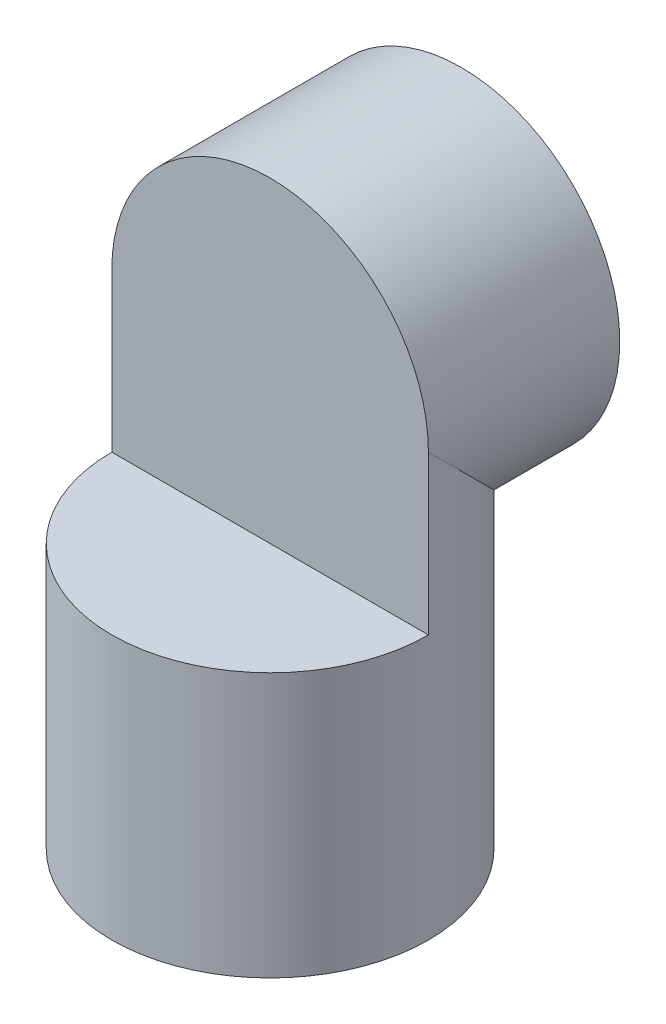
ISO-10303-21;
HEADER;
FILE_DESCRIPTION(('STEP AP214'),'2;1');
FILE_NAME('part.step','',(''),(''),'','','');
FILE_SCHEMA(('AUTOMOTIVE_DESIGN { 1 0 10303 214 1 1 1 1 }'));
ENDSEC;
DATA;
#1=APPLICATION_CONTEXT('core data for automotive mechanical design processes');
#2=APPLICATION_PROTOCOL_DEFINITION('international standard','automotive_design',2000,#1);
#3=PRODUCT_CONTEXT('',#1,'mechanical');
#4=PRODUCT('Part','Part','',(#3));
#5=PRODUCT_RELATED_PRODUCT_CATEGORY('part','',(#4));
#6=PRODUCT_DEFINITION_FORMATION('','',#4);
#7=PRODUCT_DEFINITION_CONTEXT('part definition',#1,'design');
#8=PRODUCT_DEFINITION('design','',#6,#7);
#9=PRODUCT_DEFINITION_SHAPE('','',#8);
#10=(LENGTH_UNIT() NAMED_UNIT(*) SI_UNIT(.MILLI.,.METRE.));
#11=(NAMED_UNIT(*) PLANE_ANGLE_UNIT() SI_UNIT($,.RADIAN.));
#12=(NAMED_UNIT(*) SI_UNIT($,.STERADIAN.) SOLID_ANGLE_UNIT());
#13=UNCERTAINTY_MEASURE_WITH_UNIT(LENGTH_MEASURE(1.E-05),#10,'distance_accuracy_value','');
#14=(GEOMETRIC_REPRESENTATION_CONTEXT(3) GLOBAL_UNCERTAINTY_ASSIGNED_CONTEXT((#13)) GLOBAL_UNIT_ASSIGNED_CONTEXT((#10,
#11,#12)) REPRESENTATION_CONTEXT('',''));
#15=CARTESIAN_POINT('',(0.,0.,0.));
#16=DIRECTION('',(0.,0.,1.));
#17=DIRECTION('',(1.,0.,0.));
#18=AXIS2_PLACEMENT_3D('',#15,#16,#17);
#19=CARTESIAN_POINT('',(3.87035861681925,10.2935424674176,-7.88415999999999));
#20=DIRECTION('',(0.0554460842403357,0.356398527819818,0.932687418758439));
#21=DIRECTION('',(0.747230831832866,-0.634386185883802,0.19799053290035));
#22=AXIS2_PLACEMENT_3D('',#19,#20,#21);
#23=SPHERICAL_SURFACE('',#22,1.30302);
#24=CARTESIAN_POINT('',(4.52186861681925,11.4219908890568,-7.88415999999999));
#25=CARTESIAN_POINT('',(4.58524511159546,11.3853941616951,-7.88415999999999));
#26=CARTESIAN_POINT('',(4.64560673372368,11.3433961616661,-7.88415999999999));
#27=CARTESIAN_POINT('',(4.73017243020277,11.2733037280284,-7.88415999999999));
#28=CARTESIAN_POINT('',(4.75738806042679,11.2487300708524,-7.88415999999999));
#29=CARTESIAN_POINT('',(4.80968111789197,11.1973554166368,-7.88415999999999));
#30=CARTESIAN_POINT('',(4.83475667093584,11.1705525070476,-7.88415999999999));
#31=CARTESIAN_POINT('',(4.90638280925672,11.0871861670358,-7.88415999999999));
#32=CARTESIAN_POINT('',(4.9494508218936,11.0275671481827,-7.88415999999999));
#33=CARTESIAN_POINT('',(5.02495351371586,10.901935907835,-7.88415999999999));
#34=CARTESIAN_POINT('',(5.05738794286766,10.8359235360571,-7.88415999999999));
#35=CARTESIAN_POINT('',(5.09737967387249,10.7335742768555,-7.88415999999999));
#36=CARTESIAN_POINT('',(5.10927196208888,10.6988785149595,-7.88415999999999));
#37=CARTESIAN_POINT('',(5.1300842864558,10.6286438280194,-7.88415999999999));
#38=CARTESIAN_POINT('',(5.13900717005937,10.5931057459455,-7.88415999999999));
#39=CARTESIAN_POINT('',(5.16123300634216,10.485524683916,-7.88415999999999));
#40=CARTESIAN_POINT('',(5.17000281024605,10.4124900792196,-7.88415999999998));
#41=CARTESIAN_POINT('',(5.17515007166113,10.2660248031217,-7.88415999999998));
#42=CARTESIAN_POINT('',(5.17152780766363,10.1925941406579,-7.88415999999999));
#43=CARTESIAN_POINT('',(5.15200841815195,10.0473733280716,-7.88415999999999));
#44=CARTESIAN_POINT('',(5.13611134336732,9.9755831711704,-7.88415999999998));
#45=CARTESIAN_POINT('',(5.09248963861125,9.83569319426743,-7.88415999999998));
#46=CARTESIAN_POINT('',(5.06476498034016,9.76759338309596,-7.88415999999998));
#47=CARTESIAN_POINT('',(4.99827703133339,9.63701444543887,-7.88415999999999));
#48=CARTESIAN_POINT('',(4.95951374780123,9.57453531528537,-7.88415999999999));
#49=CARTESIAN_POINT('',(4.87204557098117,9.45697131660213,-7.88415999999999));
#50=CARTESIAN_POINT('',(4.82334072684484,9.40188641151719,-7.88415999999999));
#51=CARTESIAN_POINT('',(4.71738369070506,9.3006777302423,-7.88415999999998));
#52=CARTESIAN_POINT('',(4.66013140861379,9.25455404851313,-7.88415999999998));
#53=CARTESIAN_POINT('',(4.53865691096502,9.17256024082702,-7.88415999999998));
#54=CARTESIAN_POINT('',(4.47443443254646,9.13669050175377,-7.88415999999999));
#55=CARTESIAN_POINT('',(4.37435976297924,9.09138187086448,-7.88415999999999));
#56=CARTESIAN_POINT('',(4.34037229473301,9.07769347605296,-7.88415999999999));
#57=CARTESIAN_POINT('',(4.27133280210008,9.05321055657434,-7.88415999999999));
#58=CARTESIAN_POINT('',(4.23627978198558,9.04241883747601,-7.88415999999999));
#59=CARTESIAN_POINT('',(4.12998636547158,9.01455484923799,-7.88415999999999));
#60=CARTESIAN_POINT('',(4.05752307311049,9.00195376875583,-7.88415999999999));
#61=CARTESIAN_POINT('',(3.91151313880725,8.98911211265607,-7.88415999999999));
#62=CARTESIAN_POINT('',(3.83796653815548,8.98887106714801,-7.88415999999998));
#63=CARTESIAN_POINT('',(3.72840456687758,8.99775699869372,-7.88415999999998));
#64=CARTESIAN_POINT('',(3.69196731383288,9.0022711289084,-7.88415999999999));
#65=CARTESIAN_POINT('',(3.61963737935746,9.01434557858398,-7.88415999999999));
#66=CARTESIAN_POINT('',(3.58374427949848,9.02190341992221,-7.88415999999999));
#67=CARTESIAN_POINT('',(3.47732368600113,9.049065965953,-7.88415999999999));
#68=CARTESIAN_POINT('',(3.40786108793911,9.07317557555688,-7.88415999999999));
#69=CARTESIAN_POINT('',(3.32013061080317,9.11217178748134,-7.88415999999999));
#70=CARTESIAN_POINT('',(3.29948921792143,9.12200855040117,-7.88415999999999));
#71=CARTESIAN_POINT('',(3.25875099304024,9.14275156381967,-7.88415999999999));
#72=CARTESIAN_POINT('',(3.23865416101547,9.15365781426863,-7.88415999999999));
#73=CARTESIAN_POINT('',(3.15551240025581,9.20166600908295,-7.88415999999999));
#74=CARTESIAN_POINT('',(3.09515506371442,9.24365786927063,-7.88415999999999));
#75=CARTESIAN_POINT('',(3.01058898232589,9.31374155834508,-7.88415999999999));
#76=CARTESIAN_POINT('',(2.98336356021063,9.3383222890233,-7.88415999999999));
#77=CARTESIAN_POINT('',(2.93105229755303,9.38971241393906,-7.88415999999999));
#78=CARTESIAN_POINT('',(2.90596821491817,9.41652360426644,-7.88415999999999));
#79=CARTESIAN_POINT('',(2.834334435861,9.49989858890438,-7.88415999999999));
#80=CARTESIAN_POINT('',(2.79126695017534,9.55951697737441,-7.88415999999999));
#81=CARTESIAN_POINT('',(2.71576428020977,9.68514800809728,-7.88415999999999));
#82=CARTESIAN_POINT('',(2.68332950021766,9.75116089336473,-7.88415999999999));
#83=CARTESIAN_POINT('',(2.64333779118745,9.85351005038402,-7.88415999999999));
#84=CARTESIAN_POINT('',(2.63144569673557,9.88820517498683,-7.88415999999999));
#85=CARTESIAN_POINT('',(2.61063366945449,9.95843847955993,-7.88415999999999));
#86=CARTESIAN_POINT('',(2.60171088206037,9.99397581444322,-7.88415999999999));
#87=CARTESIAN_POINT('',(2.57948456448724,10.1015574477484,-7.88415999999999));
#88=CARTESIAN_POINT('',(2.57071447703095,10.1745934529341,-7.88415999999999));
#89=CARTESIAN_POINT('',(2.56556715023456,10.3210603422578,-7.88415999999999));
#90=CARTESIAN_POINT('',(2.56918943067176,10.3944912109843,-7.88415999999999));
#91=CARTESIAN_POINT('',(2.58870892276454,10.539712023188,-7.88415999999999));
#92=CARTESIAN_POINT('',(2.60460601351572,10.6115019828209,-7.88415999999999));
#93=CARTESIAN_POINT('',(2.64822778009966,10.7513925101529,-7.88415999999999));
#94=CARTESIAN_POINT('',(2.67595265142324,10.8194930168515,-7.88415999999999));
#95=CARTESIAN_POINT('',(2.74244130918317,10.9500719800385,-7.88415999999999));
#96=CARTESIAN_POINT('',(2.78120483942072,11.012550566963,-7.88415999999999));
#97=CARTESIAN_POINT('',(2.86866747800773,11.1301088655871,-7.88415999999999));
#98=CARTESIAN_POINT('',(2.91736589386233,11.1851890925336,-7.88415999999999));
#99=CARTESIAN_POINT('',(3.02332798949608,11.2864011938424,-7.88415999999999));
#100=CARTESIAN_POINT('',(3.08059306051384,11.3325316119413,-7.88415999999998));
#101=CARTESIAN_POINT('',(3.20207114071159,11.4145361556932,-7.88415999999998));
#102=CARTESIAN_POINT('',(3.26628647109733,11.4504068402025,-7.88415999999999));
#103=CARTESIAN_POINT('',(3.39979203104228,11.5108297513031,-7.88415999999999));
#104=CARTESIAN_POINT('',(3.46907799230358,11.5353913733461,-7.88415999999998));
#105=CARTESIAN_POINT('',(3.59376743926616,11.5680874525024,-7.88415999999998));
#106=CARTESIAN_POINT('',(3.64852373284443,11.5787468193743,-7.88415999999999));
#107=CARTESIAN_POINT('',(3.75896706335442,11.5929859875889,-7.88415999999999));
#108=CARTESIAN_POINT('',(3.81465437144129,11.5965636888757,-7.88415999999999));
#109=CARTESIAN_POINT('',(3.9436276211118,11.5965608608072,-7.88415999999999));
#110=CARTESIAN_POINT('',(4.01692592812468,11.5903674628555,-7.88415999999999));
#111=CARTESIAN_POINT('',(4.16140470359913,11.5657521157546,-7.88415999999999));
#112=CARTESIAN_POINT('',(4.23258655021281,11.5473383146794,-7.88415999999999));
#113=CARTESIAN_POINT('',(4.339844406405,11.5097188509967,-7.88415999999999));
#114=CARTESIAN_POINT('',(4.37738094611545,11.4945518372074,-7.88415999999999));
#115=CARTESIAN_POINT('',(4.45087484622059,11.4608034294557,-7.88415999999999));
#116=CARTESIAN_POINT('',(4.48683242941318,11.4422225191402,-7.88415999999999));
#117=CARTESIAN_POINT('',(4.52186861681925,11.4219908890568,-7.88415999999999));
#118=B_SPLINE_CURVE_WITH_KNOTS('',3,(#24,#25,#26,#27,#28,#29,#30,#31,#32,#33,#34,#35,#36,#37,
#38,#39,#40,#41,#42,#43,#44,#45,#46,#47,#48,#49,#50,#51,#52,#53,#54,#55,#56,#57,#58,#59,#60,#61,
#62,#63,#64,#65,#66,#67,#68,#69,#70,#71,#72,#73,#74,#75,#76,#77,#78,#79,#80,#81,#82,#83,#84,#85,
#86,#87,#88,#89,#90,#91,#92,#93,#94,#95,#96,#97,#98,#99,#100,#101,#102,#103,#104,#105,#106,#107,
#108,#109,#110,#111,#112,#113,#114,#115,#116,#117),.UNSPECIFIED.,.T.,.F.,(4,2,2,2,2,2,2,2,2,2,2,
2,2,2,2,2,2,2,2,2,2,2,2,2,2,2,2,2,2,2,2,2,2,2,2,2,2,2,2,2,2,2,2,2,2,2,4),(0.,0.219378386419227,
0.329278248766021,0.439273390150621,0.658809610523647,0.878350992608082,0.988268226187612,
1.09807975098427,1.31762393973005,1.53716319461425,1.75670154218772,1.97624041504927,
2.19577914464539,2.41531678885722,2.63485674710303,2.85440498755087,2.96421434799376,
3.07412968338468,3.29367265779028,3.51320728584178,3.62323684713202,3.73317700530027,
3.95248087473943,4.02105825996424,4.08963564200267,4.30893948324564,4.41887965554408,
4.52890923097547,4.74844385900095,4.96798683343258,5.07790209388056,5.1877113791566,
5.40725976931368,5.62679965174047,5.84633737177132,6.06587872048561,6.28541497422878,
6.50493593078377,6.72449257667609,6.94412277636537,7.16357017886179,7.33048511739908,
7.49744954686479,7.71706148875941,7.9365271491483,8.05782244173021,8.17910056363588),.UNSPECIFIED.);
#119=CARTESIAN_POINT('',(4.52186861681925,11.4219908890568,-7.88415999999999));
#120=VERTEX_POINT('',#119);
#121=EDGE_CURVE('E114',#120,#120,#118,.T.);
#122=ORIENTED_EDGE('',*,*,#121,.T.);
#123=EDGE_LOOP('',(#122));
#124=FACE_BOUND('',#123,.T.);
#125=CARTESIAN_POINT('',(3.7981112601324,9.82914805769781,-9.09947036039061));
#126=VERTEX_POINT('',#125);
#127=VERTEX_LOOP('',#126);
#128=FACE_BOUND('',#127,.T.);
#129=ADVANCED_FACE('F16',(#124,#128),#23,.T.);
#130=CARTESIAN_POINT('',(-4.95227482907353,7.59619273174486,-7.88415999999999));
#131=DIRECTION('',(0.0554460842403357,0.356398527819818,0.932687418758439));
#132=DIRECTION('',(0.747230831832866,-0.634386185883802,0.19799053290035));
#133=AXIS2_PLACEMENT_3D('',#130,#131,#132);
#134=SPHERICAL_SURFACE('',#133,1.30302);
#135=CARTESIAN_POINT('',(-3.64925482907353,7.59619273174486,-7.88415999999999));
#136=CARTESIAN_POINT('',(-3.64926013323451,7.52298608795469,-7.88415999999999));
#137=CARTESIAN_POINT('',(-3.65545301004078,7.44970695941227,-7.88415999999999));
#138=CARTESIAN_POINT('',(-3.67387633003305,7.34142183427563,-7.88415999999999));
#139=CARTESIAN_POINT('',(-3.68154924971922,7.30557195673762,-7.88415999999999));
#140=CARTESIAN_POINT('',(-3.69989218882068,7.23461001622985,-7.88415999999999));
#141=CARTESIAN_POINT('',(-3.71056486754989,7.19949863776709,-7.88415999999999));
#142=CARTESIAN_POINT('',(-3.74694719846247,7.09579128268684,-7.88415999999999));
#143=CARTESIAN_POINT('',(-3.77704488210218,7.02868346285482,-7.88415999999999));
#144=CARTESIAN_POINT('',(-3.84809344444015,6.90048053828299,-7.88415999999999));
#145=CARTESIAN_POINT('',(-3.88904451513782,6.83938553993786,-7.88415999999998));
#146=CARTESIAN_POINT('',(-3.95768571586553,6.7535770583075,-7.88415999999998));
#147=CARTESIAN_POINT('',(-3.98178713860005,6.72592998652058,-7.88415999999999));
#148=CARTESIAN_POINT('',(-4.03220636111199,6.67278831331038,-7.88415999999999));
#149=CARTESIAN_POINT('',(-4.05852200921787,6.64729166938281,-7.88415999999999));
#150=CARTESIAN_POINT('',(-4.14057693780854,6.57425324129018,-7.88415999999999));
#151=CARTESIAN_POINT('',(-4.19944148998978,6.53014139322371,-7.88415999999999));
#152=CARTESIAN_POINT('',(-4.32371006126056,6.45245137600196,-7.88415999999999));
#153=CARTESIAN_POINT('',(-4.3891139727794,6.41887303361091,-7.88415999999999));
#154=CARTESIAN_POINT('',(-4.52463857529629,6.36316690106079,-7.88415999999998));
#155=CARTESIAN_POINT('',(-4.59475925226998,6.34103907685762,-7.88415999999998));
#156=CARTESIAN_POINT('',(-4.73771840709602,6.30887158640024,-7.88415999999998));
#157=CARTESIAN_POINT('',(-4.81055688939089,6.29883193990629,-7.88415999999998));
#158=CARTESIAN_POINT('',(-4.95688554084974,6.29112271957427,-7.88415999999999));
#159=CARTESIAN_POINT('',(-5.03037570982069,6.29345314207251,-7.88415999999999));
#160=CARTESIAN_POINT('',(-5.17592322952622,6.31042080842255,-7.88415999999999));
#161=CARTESIAN_POINT('',(-5.24798058742457,6.32505799072726,-7.88415999999999));
#162=CARTESIAN_POINT('',(-5.38860839370869,6.36621513796668,-7.88415999999999));
#163=CARTESIAN_POINT('',(-5.45717880617751,6.39273522527255,-7.88415999999999));
#164=CARTESIAN_POINT('',(-5.58892476649786,6.45693831796772,-7.88415999999999));
#165=CARTESIAN_POINT('',(-5.65210011014942,6.49462174564139,-7.88415999999999));
#166=CARTESIAN_POINT('',(-5.7413758700395,6.55863463581959,-7.88415999999999));
#167=CARTESIAN_POINT('',(-5.77022410224404,6.58122444958748,-7.88415999999999));
#168=CARTESIAN_POINT('',(-5.8259466796095,6.62877294492256,-7.88415999999999));
#169=CARTESIAN_POINT('',(-5.8528190929406,6.6537338915996,-7.88415999999999));
#170=CARTESIAN_POINT('',(-5.93009672320717,6.73185469678521,-7.88415999999999));
#171=CARTESIAN_POINT('',(-5.97724122519228,6.78830920855986,-7.88415999999999));
#172=CARTESIAN_POINT('',(-6.06136739275452,6.90833669281432,-7.88415999999999));
#173=CARTESIAN_POINT('',(-6.0983494446195,6.97190939459322,-7.88415999999999));
#174=CARTESIAN_POINT('',(-6.14543499163566,7.07123581886392,-7.88415999999999));
#175=CARTESIAN_POINT('',(-6.15974426985393,7.10504847913332,-7.88415999999999));
#176=CARTESIAN_POINT('',(-6.1854524617719,7.17372528189841,-7.88415999999999));
#177=CARTESIAN_POINT('',(-6.196853730805,7.20858854770153,-7.88415999999999));
#178=CARTESIAN_POINT('',(-6.22654056592724,7.31433275084445,-7.88415999999999));
#179=CARTESIAN_POINT('',(-6.24039232567356,7.3865439127042,-7.88415999999999));
#180=CARTESIAN_POINT('',(-6.25048585144912,7.48201881583139,-7.88415999999999));
#181=CARTESIAN_POINT('',(-6.25228766094182,7.50481316083971,-7.88415999999999));
#182=CARTESIAN_POINT('',(-6.2546927975489,7.55046500516846,-7.88415999999999));
#183=CARTESIAN_POINT('',(-6.25529612397902,7.57332250452494,-7.88415999999999));
#184=CARTESIAN_POINT('',(-6.25529068809438,7.66932944722695,-7.88415999999999));
#185=CARTESIAN_POINT('',(-6.24910334540213,7.74259632508082,-7.88415999999999));
#186=CARTESIAN_POINT('',(-6.23069214408464,7.85087452446103,-7.88415999999999));
#187=CARTESIAN_POINT('',(-6.22301731677818,7.88674281401864,-7.88415999999999));
#188=CARTESIAN_POINT('',(-6.20466778872739,7.95774079732341,-7.88415999999999));
#189=CARTESIAN_POINT('',(-6.19399065314793,7.99286986661469,-7.88415999999999));
#190=CARTESIAN_POINT('',(-6.15760266549476,8.09659408893003,-7.88415999999999));
#191=CARTESIAN_POINT('',(-6.12750534354986,8.16370085464712,-7.88415999999999));
#192=CARTESIAN_POINT('',(-6.05645701914395,8.29190359379009,-7.88415999999999));
#193=CARTESIAN_POINT('',(-6.01550561562198,8.35299934499311,-7.88415999999999));
#194=CARTESIAN_POINT('',(-5.94686709352054,8.43880445967804,-7.88415999999999));
#195=CARTESIAN_POINT('',(-5.9227691421672,8.46644783261777,-7.88415999999999));
#196=CARTESIAN_POINT('',(-5.87235760257589,8.51958273558884,-7.88415999999999));
#197=CARTESIAN_POINT('',(-5.84604616409878,8.54507630641501,-7.88415999999999));
#198=CARTESIAN_POINT('',(-5.76398864016459,8.61812005816577,-7.88415999999999));
#199=CARTESIAN_POINT('',(-5.70511483629564,8.66223890537681,-7.88415999999999));
#200=CARTESIAN_POINT('',(-5.58080702873803,8.73995544490071,-7.88415999999999));
#201=CARTESIAN_POINT('',(-5.51537040813671,8.77354891804166,-7.88415999999999));
#202=CARTESIAN_POINT('',(-5.37982548603953,8.82924409236902,-7.88415999999999));
#203=CARTESIAN_POINT('',(-5.309722458685,8.85135852687703,-7.88415999999999));
#204=CARTESIAN_POINT('',(-5.19140587531833,8.87798636586236,-7.88415999999999));
#205=CARTESIAN_POINT('',(-5.14393633015925,8.88593560360622,-7.88415999999999));
#206=CARTESIAN_POINT('',(-5.0484097643924,8.89654979864893,-7.88415999999999));
#207=CARTESIAN_POINT('',(-5.00035274348658,8.89921475326663,-7.88415999999999));
#208=CARTESIAN_POINT('',(-4.87907732348959,8.89920965402503,-7.88415999999999));
#209=CARTESIAN_POINT('',(-4.8058313881062,8.8930246979751,-7.88415999999999));
#210=CARTESIAN_POINT('',(-4.66136166778535,8.86843914159504,-7.88415999999999));
#211=CARTESIAN_POINT('',(-4.59014020851846,8.85002504070165,-7.88415999999999));
#212=CARTESIAN_POINT('',(-4.451824801241,8.8015050319548,-7.88415999999999));
#213=CARTESIAN_POINT('',(-4.38472912579874,8.77140405644534,-7.88415999999999));
#214=CARTESIAN_POINT('',(-4.25656315203348,8.70037283298813,-7.88415999999999));
#215=CARTESIAN_POINT('',(-4.19549128250978,8.65944541922999,-7.88415999999999));
#216=CARTESIAN_POINT('',(-4.08108390926332,8.56792004869084,-7.88415999999999));
#217=CARTESIAN_POINT('',(-4.02774840680617,8.51732209032779,-7.88415999999999));
#218=CARTESIAN_POINT('',(-3.93031502640777,8.40787492025768,-7.88415999999999));
#219=CARTESIAN_POINT('',(-3.8862195655907,8.34902355622688,-7.88415999999999));
#220=CARTESIAN_POINT('',(-3.80852039016171,8.22473280732671,-7.88415999999999));
#221=CARTESIAN_POINT('',(-3.77492110500135,8.15929065646808,-7.88415999999999));
#222=CARTESIAN_POINT('',(-3.71922145857753,8.02374213970403,-7.88415999999999));
#223=CARTESIAN_POINT('',(-3.69710844789485,7.95364100098458,-7.88415999999999));
#224=CARTESIAN_POINT('',(-3.67048161354327,7.83532350741838,-7.88415999999999));
#225=CARTESIAN_POINT('',(-3.66253241632917,7.78785260454892,-7.88415999999999));
#226=CARTESIAN_POINT('',(-3.65191728523269,7.6923291349659,-7.88415999999999));
#227=CARTESIAN_POINT('',(-3.64925134517645,7.64427656893213,-7.88415999999999));
#228=CARTESIAN_POINT('',(-3.64925482907353,7.59619273174486,-7.88415999999999));
#229=B_SPLINE_CURVE_WITH_KNOTS('',3,(#135,#136,#137,#138,#139,#140,#141,#142,#143,#144,#145,
#146,#147,#148,#149,#150,#151,#152,#153,#154,#155,#156,#157,#158,#159,#160,#161,#162,#163,#164,
#165,#166,#167,#168,#169,#170,#171,#172,#173,#174,#175,#176,#177,#178,#179,#180,#181,#182,#183,
#184,#185,#186,#187,#188,#189,#190,#191,#192,#193,#194,#195,#196,#197,#198,#199,#200,#201,#202,
#203,#204,#205,#206,#207,#208,#209,#210,#211,#212,#213,#214,#215,#216,#217,#218,#219,#220,#221,
#222,#223,#224,#225,#226,#227,#228),.UNSPECIFIED.,.T.,.F.,(4,2,2,2,2,2,2,2,2,2,2,2,2,2,2,2,2,2,
2,2,2,2,2,2,2,2,2,2,2,2,2,2,2,2,2,2,2,2,2,2,2,2,2,2,2,2,4),(0.,0.219417663022593,
0.32929661535836,0.439273285303822,0.658810144569198,0.878350887761373,0.988268796858262,
1.09808110034609,1.31762383876354,1.53716296635557,1.75670144122121,1.97624027496075,
2.19577904367889,2.41531671447293,2.63485664613652,2.85440488356904,2.96421424552706,
3.07412958242624,3.2936725567881,3.51320718488335,3.6232367729082,3.73317695775453,
3.95248077392299,4.02105813797726,4.08963554118622,4.30893926645157,4.41887948915886,
4.52890913046816,4.74844387520007,4.9679867329253,5.07788943992205,5.18768661404452,
5.40725960297966,5.62692049704936,5.84633720495202,5.99045590957346,6.13457468731788,
6.35399217178003,6.57365228929639,6.79321980176309,7.01272989172723,7.23224001760174,
7.45180749415813,7.67146750477682,7.89088509613749,8.03500392152698,8.17912257850335),.UNSPECIFIED.);
#230=CARTESIAN_POINT('',(-3.64925482907353,7.59619273174486,-7.88415999999999));
#231=VERTEX_POINT('',#230);
#232=EDGE_CURVE('E112',#231,#231,#229,.T.);
#233=ORIENTED_EDGE('',*,*,#232,.T.);
#234=EDGE_LOOP('',(#233));
#235=FACE_BOUND('',#234,.T.);
#236=CARTESIAN_POINT('',(-5.02452218576037,7.13179832202509,-9.09947036039061));
#237=VERTEX_POINT('',#236);
#238=VERTEX_LOOP('',#237);
#239=FACE_BOUND('',#238,.T.);
#240=ADVANCED_FACE('F62',(#235,#239),#134,.T.);
#241=CARTESIAN_POINT('',(1.79501528785667,1.30424290715994,-7.88415999999999));
#242=DIRECTION('',(0.0554460842403357,0.356398527819818,0.932687418758439));
#243=DIRECTION('',(0.747230831832866,-0.634386185883802,0.19799053290035));
#244=AXIS2_PLACEMENT_3D('',#241,#242,#243);
#245=SPHERICAL_SURFACE('',#244,1.30302);
#246=CARTESIAN_POINT('',(1.72276793116983,0.839848497440159,-9.09947036039061));
#247=VERTEX_POINT('',#246);
#248=VERTEX_LOOP('',#247);
#249=FACE_BOUND('',#248,.T.);
#250=CARTESIAN_POINT('',(2.44652528785667,0.175794485520738,-7.88415999999999));
#251=CARTESIAN_POINT('',(2.38311513409538,0.139187516944448,-7.88415999999999));
#252=CARTESIAN_POINT('',(2.31658331775141,0.107920018965464,-7.88415999999999));
#253=CARTESIAN_POINT('',(2.1791784690996,0.0569832892573211,-7.88415999999999));
#254=CARTESIAN_POINT('',(2.10830212710155,0.0373230243185771,-7.88415999999999));
#255=CARTESIAN_POINT('',(1.96427236133052,0.0101872228764311,-7.88415999999999));
#256=CARTESIAN_POINT('',(1.89111964602088,0.00270793325134912,-7.88415999999999));
#257=CARTESIAN_POINT('',(1.74460938188207,0.000138586573471745,-7.88415999999999));
#258=CARTESIAN_POINT('',(1.67125186647279,0.00504661409531083,-7.88415999999999));
#259=CARTESIAN_POINT('',(1.52639672455706,0.027108309268628,-7.88415999999999));
#260=CARTESIAN_POINT('',(1.45489922045403,0.0442627807306186,-7.88415999999999));
#261=CARTESIAN_POINT('',(1.31579740264871,0.0903320991086586,-7.88415999999999));
#262=CARTESIAN_POINT('',(1.24819317991611,0.119247220694686,-7.88415999999999));
#263=CARTESIAN_POINT('',(1.11879946864029,0.18801658992001,-7.88415999999999));
#264=CARTESIAN_POINT('',(1.05700991773207,0.227870720215489,-7.88415999999999));
#265=CARTESIAN_POINT('',(0.94099887782925,0.317386766186831,-7.88415999999999));
#266=CARTESIAN_POINT('',(0.886777374436967,0.367048663203659,-7.88415999999999));
#267=CARTESIAN_POINT('',(0.787441476225722,0.474770822756988,-7.88415999999999));
#268=CARTESIAN_POINT('',(0.742327088768831,0.532831092082557,-7.88415999999999));
#269=CARTESIAN_POINT('',(0.662485959657491,0.65570090607362,-7.88415999999999));
#270=CARTESIAN_POINT('',(0.627759220970729,0.720510452667333,-7.88415999999998));
#271=CARTESIAN_POINT('',(0.569679983753614,0.855042153221034,-7.88415999999998));
#272=CARTESIAN_POINT('',(0.546327429181894,0.924764282974457,-7.88415999999999));
#273=CARTESIAN_POINT('',(0.511656639997048,1.06713011848868,-7.88415999999999));
#274=CARTESIAN_POINT('',(0.500338520537503,1.13977385219845,-7.88415999999998));
#275=CARTESIAN_POINT('',(0.490067058631977,1.2859707287059,-7.88415999999998));
#276=CARTESIAN_POINT('',(0.491114190242904,1.35952390626169,-7.88415999999999));
#277=CARTESIAN_POINT('',(0.501913101481949,1.46884543260158,-7.88415999999999));
#278=CARTESIAN_POINT('',(0.507052338228395,1.505123636261,-7.88415999999999));
#279=CARTESIAN_POINT('',(0.520369253430476,1.57715504107626,-7.88415999999999));
#280=CARTESIAN_POINT('',(0.528549859427236,1.6129077017762,-7.88415999999999));
#281=CARTESIAN_POINT('',(0.557565646283894,1.71889249293365,-7.88415999999999));
#282=CARTESIAN_POINT('',(0.582884440664142,1.78794808837646,-7.88415999999999));
#283=CARTESIAN_POINT('',(0.644768201001383,1.92081722602627,-7.88415999999999));
#284=CARTESIAN_POINT('',(0.681332738640199,1.9846309677632,-7.88415999999999));
#285=CARTESIAN_POINT('',(0.743809827046953,2.07507238529566,-7.88415999999999));
#286=CARTESIAN_POINT('',(0.765938537014682,2.10437178419542,-7.88415999999999));
#287=CARTESIAN_POINT('',(0.812561844497441,2.16097574973733,-7.88415999999999));
#288=CARTESIAN_POINT('',(0.837054506725293,2.18828191653741,-7.88415999999999));
#289=CARTESIAN_POINT('',(0.913788092347483,2.26686243137652,-7.88415999999999));
#290=CARTESIAN_POINT('',(0.969397910212829,2.31496250590079,-7.88415999999998));
#291=CARTESIAN_POINT('',(1.04703007505341,2.37143818697301,-7.88415999999999));
#292=CARTESIAN_POINT('',(1.06586725683787,2.38439435457533,-7.88415999999999));
#293=CARTESIAN_POINT('',(1.10420140329603,2.40930372396912,-7.88415999999998));
#294=CARTESIAN_POINT('',(1.12369850706467,2.42125671244497,-7.88415999999997));
#295=CARTESIAN_POINT('',(1.20688267731826,2.46927961346955,-7.88415999999996));
#296=CARTESIAN_POINT('',(1.27343072833325,2.50056048934721,-7.88415999999998));
#297=CARTESIAN_POINT('',(1.41087095008939,2.55150868812081,-7.88415999999999));
#298=CARTESIAN_POINT('',(1.48176636191299,2.57116722713487,-7.88415999999999));
#299=CARTESIAN_POINT('',(1.59351871988414,2.59222603247628,-7.88415999999999));
#300=CARTESIAN_POINT('',(1.63361639724518,2.59786021429218,-7.88415999999999));
#301=CARTESIAN_POINT('',(1.71413875252601,2.60537936455124,-7.88415999999999));
#302=CARTESIAN_POINT('',(1.75456328037348,2.60726596531486,-7.88415999999999));
#303=CARTESIAN_POINT('',(1.86819623008649,2.60725737471117,-7.88415999999999));
#304=CARTESIAN_POINT('',(1.94146710691626,2.60106741825367,-7.88415999999999));
#305=CARTESIAN_POINT('',(2.0497480964794,2.58264943555713,-7.88415999999999));
#306=CARTESIAN_POINT('',(2.08560582257212,2.57497570669483,-7.88415999999999));
#307=CARTESIAN_POINT('',(2.15658315837816,2.55662998093093,-7.88415999999999));
#308=CARTESIAN_POINT('',(2.19170210142324,2.54595539116646,-7.88415999999999));
#309=CARTESIAN_POINT('',(2.29541671182698,2.50957060966136,-7.88415999999999));
#310=CARTESIAN_POINT('',(2.36252421161259,2.47947303025606,-7.88415999999999));
#311=CARTESIAN_POINT('',(2.49072707889656,2.40842452995385,-7.88415999999999));
#312=CARTESIAN_POINT('',(2.55182230504683,2.36747335397325,-7.88415999999999));
#313=CARTESIAN_POINT('',(2.63763075546259,2.29883218842649,-7.88415999999999));
#314=CARTESIAN_POINT('',(2.66527762819085,2.27473095142865,-7.88415999999999));
#315=CARTESIAN_POINT('',(2.71841891518949,2.22431215602535,-7.88415999999999));
#316=CARTESIAN_POINT('',(2.7439153739269,2.1979967513654,-7.88415999999999));
#317=CARTESIAN_POINT('',(2.81695408834954,2.11594171805182,-7.88415999999999));
#318=CARTESIAN_POINT('',(2.86106632013957,2.05707672788365,-7.88415999999999));
#319=CARTESIAN_POINT('',(2.93875662983901,1.93280770518481,-7.88415999999999));
#320=CARTESIAN_POINT('',(2.97233496775292,1.86740383410367,-7.88415999999999));
#321=CARTESIAN_POINT('',(3.02804108708775,1.73187921116903,-7.88415999999999));
#322=CARTESIAN_POINT('',(3.05016889237645,1.66175846914785,-7.88415999999999));
#323=CARTESIAN_POINT('',(3.08233667554334,1.51879849078049,-7.88415999999999));
#324=CARTESIAN_POINT('',(3.09237648937863,1.44595921755566,-7.88415999999999));
#325=CARTESIAN_POINT('',(3.10008508191377,1.29963018852959,-7.88415999999999));
#326=CARTESIAN_POINT('',(3.09775417058072,1.2261404490728,-7.88415999999999));
#327=CARTESIAN_POINT('',(3.08078843019435,1.08060047681797,-7.88415999999999));
#328=CARTESIAN_POINT('',(3.06615440538831,1.00855015024152,-7.88415999999999));
#329=CARTESIAN_POINT('',(3.02499451472537,0.867916874126345,-7.88415999999999));
#330=CARTESIAN_POINT('',(2.99846679652465,0.799334466539254,-7.88415999999999));
#331=CARTESIAN_POINT('',(2.9342670308533,0.667579642736839,-7.88415999999999));
#332=CARTESIAN_POINT('',(2.89659155420672,0.604408898932023,-7.88415999999999));
#333=CARTESIAN_POINT('',(2.81118451399153,0.485327917032741,-7.88415999999999));
#334=CARTESIAN_POINT('',(2.76346073008986,0.429412115786886,-7.88415999999999));
#335=CARTESIAN_POINT('',(2.6718167574179,0.338744336273802,-7.88415999999999));
#336=CARTESIAN_POINT('',(2.62971916451925,0.302129820911197,-7.88415999999999));
#337=CARTESIAN_POINT('',(2.54119161585935,0.234578432931325,-7.88415999999999));
#338=CARTESIAN_POINT('',(2.49476165952646,0.20364156106321,-7.88415999999999));
#339=CARTESIAN_POINT('',(2.44652528785667,0.175794485520738,-7.88415999999999));
#340=B_SPLINE_CURVE_WITH_KNOTS('',3,(#250,#251,#252,#253,#254,#255,#256,#257,#258,#259,#260,
#261,#262,#263,#264,#265,#266,#267,#268,#269,#270,#271,#272,#273,#274,#275,#276,#277,#278,#279,
#280,#281,#282,#283,#284,#285,#286,#287,#288,#289,#290,#291,#292,#293,#294,#295,#296,#297,#298,
#299,#300,#301,#302,#303,#304,#305,#306,#307,#308,#309,#310,#311,#312,#313,#314,#315,#316,#317,
#318,#319,#320,#321,#322,#323,#324,#325,#326,#327,#328,#329,#330,#331,#332,#333,#334,#335,#336,
#337,#338,#339),.UNSPECIFIED.,.T.,.F.,(4,2,2,2,2,2,2,2,2,2,2,2,2,2,2,2,2,2,2,2,2,2,2,2,2,2,2,2,
2,2,2,2,2,2,2,2,2,2,2,2,2,2,2,2,4),(0.,0.219454145571273,0.439077602224353,0.658633377137384,
0.878155204672647,1.09769144211979,1.31723280713011,1.53677181719073,1.75631040958778,
1.97584917945622,2.19538801204546,2.4149257629412,2.63446561450309,2.85401388277409,
2.9638232295507,3.0737385507103,3.29328153230315,3.51281615316741,3.62284909642525,
3.73279271143866,3.95208976024496,4.02065987188946,4.08924452750766,4.30870050452155,
4.52832212974201,4.64963526274175,4.77089554421841,4.99026516777055,5.10016943522743,
5.21016895775205,5.42970517895694,5.64924656020951,5.75916366281478,5.86897505723086,
6.08851950663413,6.30805853667022,6.5275971090918,6.74713866077915,6.96667471154923,
7.18619641249267,7.40575231399738,7.62537582370605,7.84482991622144,8.01176958921685,
8.17870928423955),.UNSPECIFIED.);
#341=CARTESIAN_POINT('',(2.44652528785667,0.175794485520738,-7.88415999999999));
#342=VERTEX_POINT('',#341);
#343=EDGE_CURVE('E110',#342,#342,#340,.T.);
#344=ORIENTED_EDGE('',*,*,#343,.T.);
#345=EDGE_LOOP('',(#344));
#346=FACE_BOUND('',#345,.T.);
#347=ADVANCED_FACE('F68',(#249,#346),#245,.T.);
#348=CARTESIAN_POINT('',(0.,6.45287,-7.88415999999999));
#349=DIRECTION('',(0.,0.,1.));
#350=DIRECTION('',(1.,0.,0.));
#351=AXIS2_PLACEMENT_3D('',#348,#349,#350);
#352=PLANE('',#351);
#353=CARTESIAN_POINT('',(0.,6.45287,-7.88415999999999));
#354=DIRECTION('',(0.,0.,1.));
#355=DIRECTION('',(1.,0.,0.));
#356=AXIS2_PLACEMENT_3D('',#353,#354,#355);
#357=CIRCLE('',#356,7.72922);
#358=CARTESIAN_POINT('',(7.72922,6.45287,-7.88415999999999));
#359=VERTEX_POINT('',#358);
#360=EDGE_CURVE('E133',#359,#359,#357,.T.);
#361=ORIENTED_EDGE('',*,*,#360,.F.);
#362=EDGE_LOOP('',(#361));
#363=FACE_BOUND('',#362,.T.);
#364=ORIENTED_EDGE('',*,*,#343,.F.);
#365=EDGE_LOOP('',(#364));
#366=FACE_BOUND('',#365,.T.);
#367=ORIENTED_EDGE('',*,*,#232,.F.);
#368=EDGE_LOOP('',(#367));
#369=FACE_BOUND('',#368,.T.);
#370=ORIENTED_EDGE('',*,*,#121,.F.);
#371=EDGE_LOOP('',(#370));
#372=FACE_BOUND('',#371,.T.);
#373=ADVANCED_FACE('F93',(#363,#366,#369,#372),#352,.F.);
#374=CARTESIAN_POINT('',(11.3796992217958,-1.27635,1.45796000000001));
#375=DIRECTION('',(0.,-1.,0.));
#376=DIRECTION('',(0.,0.,-1.));
#377=AXIS2_PLACEMENT_3D('',#374,#375,#376);
#378=PLANE('',#377);
#379=DIRECTION('',(1.,0.,0.));
#380=VECTOR('',#379,1.);
#381=CARTESIAN_POINT('',(-2.47986509012892,-1.27635,1.45796000000001));
#382=LINE('',#381,#380);
#383=CARTESIAN_POINT('',(-7.72922,-1.27635,1.45796000000002));
#384=VERTEX_POINT('',#383);
#385=CARTESIAN_POINT('',(7.72922,-1.27635,1.45796000000001));
#386=VERTEX_POINT('',#385);
#387=EDGE_CURVE('E132',#384,#386,#382,.T.);
#388=ORIENTED_EDGE('',*,*,#387,.F.);
#389=CARTESIAN_POINT('',(0.,-1.27635,1.45796000000002));
#390=DIRECTION('',(0.,-1.,0.));
#391=DIRECTION('',(0.,0.,-1.));
#392=AXIS2_PLACEMENT_3D('',#389,#390,#391);
#393=CIRCLE('',#392,7.72922);
#394=EDGE_CURVE('E51',#386,#384,#393,.T.);
#395=ORIENTED_EDGE('',*,*,#394,.F.);
#396=EDGE_LOOP('',(#388,#395));
#397=FACE_BOUND('',#396,.T.);
#398=ADVANCED_FACE('F90',(#397),#378,.F.);
#399=CARTESIAN_POINT('',(0.,-14.18209,1.45796000000002));
#400=DIRECTION('',(0.,-1.,0.));
#401=DIRECTION('',(0.,0.,-1.));
#402=AXIS2_PLACEMENT_3D('',#399,#400,#401);
#403=PLANE('',#402);
#404=CARTESIAN_POINT('',(0.,-14.18209,1.45796000000002));
#405=DIRECTION('',(0.,-1.,0.));
#406=DIRECTION('',(0.,0.,-1.));
#407=AXIS2_PLACEMENT_3D('',#404,#405,#406);
#408=CIRCLE('',#407,7.72922);
#409=CARTESIAN_POINT('',(0.,-14.18209,-6.27125999999998));
#410=VERTEX_POINT('',#409);
#411=EDGE_CURVE('E129',#410,#410,#408,.F.);
#412=ORIENTED_EDGE('',*,*,#411,.F.);
#413=EDGE_LOOP('',(#412));
#414=FACE_BOUND('',#413,.T.);
#415=ADVANCED_FACE('F87',(#414),#403,.T.);
#416=CARTESIAN_POINT('',(0.,6.45287,-7.88415999999999));
#417=DIRECTION('',(0.,0.,1.));
#418=DIRECTION('',(1.,0.,0.));
#419=AXIS2_PLACEMENT_3D('',#416,#417,#418);
#420=CYLINDRICAL_SURFACE('',#419,7.72922);
#421=CARTESIAN_POINT('',(0.,6.45287,1.45796000000001));
#422=DIRECTION('',(0.,0.,1.));
#423=DIRECTION('',(1.,0.,0.));
#424=AXIS2_PLACEMENT_3D('',#421,#422,#423);
#425=CIRCLE('',#424,7.72922);
#426=CARTESIAN_POINT('',(7.72922,6.45287,1.45796000000001));
#427=VERTEX_POINT('',#426);
#428=CARTESIAN_POINT('',(-7.72922,6.45287,1.45796000000001));
#429=VERTEX_POINT('',#428);
#430=EDGE_CURVE('E39',#427,#429,#425,.T.);
#431=ORIENTED_EDGE('',*,*,#430,.F.);
#432=CARTESIAN_POINT('',(0.,6.45287,1.45796000000001));
#433=DIRECTION('',(0.,-0.707106781186547,0.707106781186548));
#434=DIRECTION('',(0.,0.707106781186548,0.707106781186547));
#435=AXIS2_PLACEMENT_3D('',#432,#433,#434);
#436=ELLIPSE('',#435,10.9307677505654,7.72922);
#437=EDGE_CURVE('E31',#429,#427,#436,.T.);
#438=ORIENTED_EDGE('',*,*,#437,.F.);
#439=EDGE_LOOP('',(#431,#438));
#440=FACE_BOUND('',#439,.T.);
#441=ORIENTED_EDGE('',*,*,#360,.T.);
#442=EDGE_LOOP('',(#441));
#443=FACE_BOUND('',#442,.T.);
#444=ADVANCED_FACE('F79',(#440,#443),#420,.T.);
#445=CARTESIAN_POINT('',(-2.47986509012892,19.1955976043585,1.45796000000001));
#446=DIRECTION('',(0.,0.,1.));
#447=DIRECTION('',(1.,0.,0.));
#448=AXIS2_PLACEMENT_3D('',#445,#446,#447);
#449=PLANE('',#448);
#450=DIRECTION('',(0.,-1.,0.));
#451=VECTOR('',#450,1.);
#452=CARTESIAN_POINT('',(7.72922,6.45287,1.45796000000001));
#453=LINE('',#452,#451);
#454=EDGE_CURVE('E11',#427,#386,#453,.T.);
#455=ORIENTED_EDGE('',*,*,#454,.F.);
#456=ORIENTED_EDGE('',*,*,#430,.T.);
#457=DIRECTION('',(0.,-1.,0.));
#458=VECTOR('',#457,1.);
#459=CARTESIAN_POINT('',(-7.72922,6.45287,1.45796000000002));
#460=LINE('',#459,#458);
#461=EDGE_CURVE('E128',#384,#429,#460,.F.);
#462=ORIENTED_EDGE('',*,*,#461,.F.);
#463=ORIENTED_EDGE('',*,*,#387,.T.);
#464=EDGE_LOOP('',(#455,#456,#462,#463));
#465=FACE_BOUND('',#464,.T.);
#466=ADVANCED_FACE('F73',(#465),#449,.T.);
#467=CARTESIAN_POINT('',(0.,6.45287,1.45796000000001));
#468=DIRECTION('',(0.,-1.,0.));
#469=DIRECTION('',(0.,0.,-1.));
#470=AXIS2_PLACEMENT_3D('',#467,#468,#469);
#471=CYLINDRICAL_SURFACE('',#470,7.72922);
#472=ORIENTED_EDGE('',*,*,#411,.T.);
#473=EDGE_LOOP('',(#472));
#474=FACE_BOUND('',#473,.T.);
#475=ORIENTED_EDGE('',*,*,#437,.T.);
#476=ORIENTED_EDGE('',*,*,#454,.T.);
#477=ORIENTED_EDGE('',*,*,#394,.T.);
#478=ORIENTED_EDGE('',*,*,#461,.T.);
#479=EDGE_LOOP('',(#475,#476,#477,#478));
#480=FACE_BOUND('',#479,.T.);
#481=ADVANCED_FACE('F71',(#474,#480),#471,.T.);
#482=CLOSED_SHELL('',(#129,#240,#347,#373,#398,#415,#444,#466,#481));
#483=MANIFOLD_SOLID_BREP('B1',#482);
#484=ADVANCED_BREP_SHAPE_REPRESENTATION('',(#18,#483),#14);
#485=SHAPE_DEFINITION_REPRESENTATION(#9,#484);
ENDSEC;
END-ISO-10303-21;
